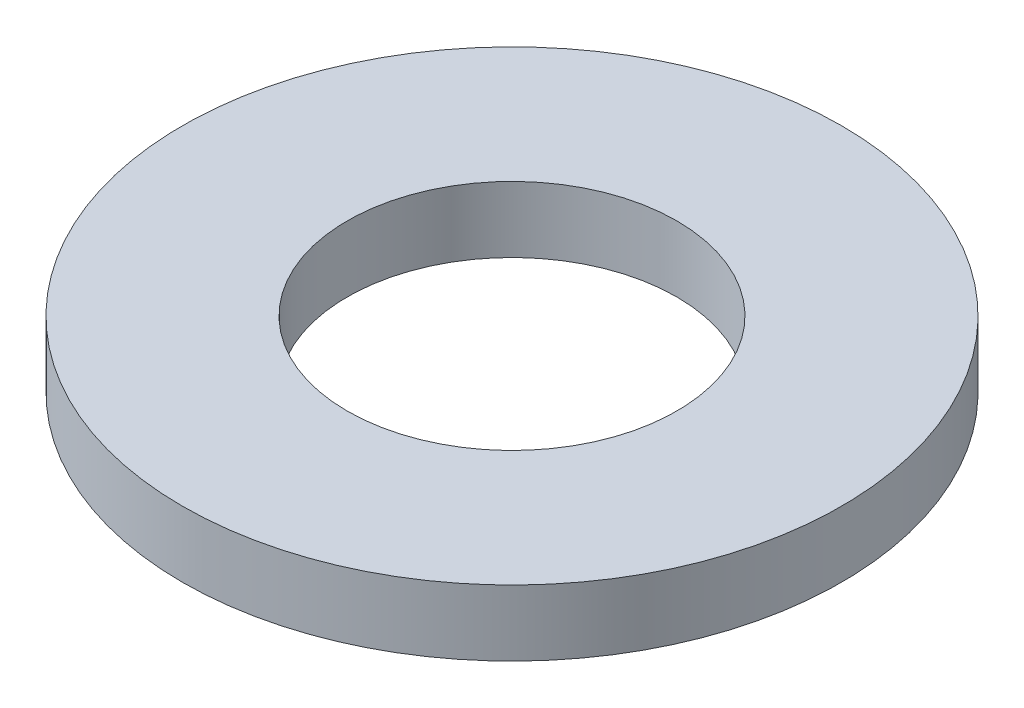
ISO-10303-21;
HEADER;
FILE_DESCRIPTION(('STEP AP214'),'2;1');
FILE_NAME('part.step','',(''),(''),'','','');
FILE_SCHEMA(('AUTOMOTIVE_DESIGN { 1 0 10303 214 1 1 1 1 }'));
ENDSEC;
DATA;
#1=APPLICATION_CONTEXT('core data for automotive mechanical design processes');
#2=APPLICATION_PROTOCOL_DEFINITION('international standard','automotive_design',2000,#1);
#3=PRODUCT_CONTEXT('',#1,'mechanical');
#4=PRODUCT('Part','Part','',(#3));
#5=PRODUCT_RELATED_PRODUCT_CATEGORY('part','',(#4));
#6=PRODUCT_DEFINITION_FORMATION('','',#4);
#7=PRODUCT_DEFINITION_CONTEXT('part definition',#1,'design');
#8=PRODUCT_DEFINITION('design','',#6,#7);
#9=PRODUCT_DEFINITION_SHAPE('','',#8);
#10=(LENGTH_UNIT() NAMED_UNIT(*) SI_UNIT(.MILLI.,.METRE.));
#11=(NAMED_UNIT(*) PLANE_ANGLE_UNIT() SI_UNIT($,.RADIAN.));
#12=(NAMED_UNIT(*) SI_UNIT($,.STERADIAN.) SOLID_ANGLE_UNIT());
#13=UNCERTAINTY_MEASURE_WITH_UNIT(LENGTH_MEASURE(1.E-05),#10,'distance_accuracy_value','');
#14=(GEOMETRIC_REPRESENTATION_CONTEXT(3) GLOBAL_UNCERTAINTY_ASSIGNED_CONTEXT((#13)) GLOBAL_UNIT_ASSIGNED_CONTEXT((#10,
#11,#12)) REPRESENTATION_CONTEXT('',''));
#15=CARTESIAN_POINT('',(0.,0.,0.));
#16=DIRECTION('',(0.,0.,1.));
#17=DIRECTION('',(1.,0.,0.));
#18=AXIS2_PLACEMENT_3D('',#15,#16,#17);
#19=CARTESIAN_POINT('',(0.,7.,0.));
#20=DIRECTION('',(0.,-1.,0.));
#21=DIRECTION('',(0.,0.,-1.));
#22=AXIS2_PLACEMENT_3D('',#19,#20,#21);
#23=CYLINDRICAL_SURFACE('',#22,35.);
#24=CARTESIAN_POINT('',(0.,7.,0.));
#25=DIRECTION('',(0.,1.,0.));
#26=DIRECTION('',(0.,0.,1.));
#27=AXIS2_PLACEMENT_3D('',#24,#25,#26);
#28=CIRCLE('',#27,35.);
#29=CARTESIAN_POINT('',(0.,7.,35.));
#30=VERTEX_POINT('',#29);
#31=EDGE_CURVE('E10',#30,#30,#28,.T.);
#32=ORIENTED_EDGE('',*,*,#31,.F.);
#33=EDGE_LOOP('',(#32));
#34=FACE_BOUND('',#33,.T.);
#35=CARTESIAN_POINT('',(0.,0.,0.));
#36=DIRECTION('',(0.,1.,0.));
#37=DIRECTION('',(0.,0.,1.));
#38=AXIS2_PLACEMENT_3D('',#35,#36,#37);
#39=CIRCLE('',#38,35.);
#40=CARTESIAN_POINT('',(0.,0.,35.));
#41=VERTEX_POINT('',#40);
#42=EDGE_CURVE('E37',#41,#41,#39,.T.);
#43=ORIENTED_EDGE('',*,*,#42,.T.);
#44=EDGE_LOOP('',(#43));
#45=FACE_BOUND('',#44,.T.);
#46=ADVANCED_FACE('F40',(#34,#45),#23,.T.);
#47=CARTESIAN_POINT('',(0.,7.,0.));
#48=DIRECTION('',(0.,1.,0.));
#49=DIRECTION('',(0.,0.,1.));
#50=AXIS2_PLACEMENT_3D('',#47,#48,#49);
#51=PLANE('',#50);
#52=CARTESIAN_POINT('',(0.,7.,0.));
#53=DIRECTION('',(0.,1.,0.));
#54=DIRECTION('',(0.,0.,1.));
#55=AXIS2_PLACEMENT_3D('',#52,#53,#54);
#56=CIRCLE('',#55,17.5);
#57=CARTESIAN_POINT('',(0.,7.,17.5));
#58=VERTEX_POINT('',#57);
#59=EDGE_CURVE('E50',#58,#58,#56,.T.);
#60=ORIENTED_EDGE('',*,*,#59,.F.);
#61=EDGE_LOOP('',(#60));
#62=FACE_BOUND('',#61,.T.);
#63=ORIENTED_EDGE('',*,*,#31,.T.);
#64=EDGE_LOOP('',(#63));
#65=FACE_BOUND('',#64,.T.);
#66=ADVANCED_FACE('F59',(#62,#65),#51,.T.);
#67=CARTESIAN_POINT('',(0.,0.,0.));
#68=DIRECTION('',(0.,1.,0.));
#69=DIRECTION('',(0.,0.,1.));
#70=AXIS2_PLACEMENT_3D('',#67,#68,#69);
#71=PLANE('',#70);
#72=CARTESIAN_POINT('',(0.,0.,0.));
#73=DIRECTION('',(0.,1.,0.));
#74=DIRECTION('',(0.,0.,1.));
#75=AXIS2_PLACEMENT_3D('',#72,#73,#74);
#76=CIRCLE('',#75,17.5);
#77=CARTESIAN_POINT('',(0.,0.,17.5));
#78=VERTEX_POINT('',#77);
#79=EDGE_CURVE('E47',#78,#78,#76,.T.);
#80=ORIENTED_EDGE('',*,*,#79,.T.);
#81=EDGE_LOOP('',(#80));
#82=FACE_BOUND('',#81,.T.);
#83=ORIENTED_EDGE('',*,*,#42,.F.);
#84=EDGE_LOOP('',(#83));
#85=FACE_BOUND('',#84,.T.);
#86=ADVANCED_FACE('F58',(#82,#85),#71,.F.);
#87=CARTESIAN_POINT('',(0.,7.,0.));
#88=DIRECTION('',(0.,-1.,0.));
#89=DIRECTION('',(0.,0.,-1.));
#90=AXIS2_PLACEMENT_3D('',#87,#88,#89);
#91=CYLINDRICAL_SURFACE('',#90,17.5);
#92=ORIENTED_EDGE('',*,*,#59,.T.);
#93=EDGE_LOOP('',(#92));
#94=FACE_BOUND('',#93,.T.);
#95=ORIENTED_EDGE('',*,*,#79,.F.);
#96=EDGE_LOOP('',(#95));
#97=FACE_BOUND('',#96,.T.);
#98=ADVANCED_FACE('F54',(#94,#97),#91,.F.);
#99=CLOSED_SHELL('',(#46,#66,#86,#98));
#100=MANIFOLD_SOLID_BREP('B2',#99);
#101=ADVANCED_BREP_SHAPE_REPRESENTATION('',(#18,#100),#14);
#102=SHAPE_DEFINITION_REPRESENTATION(#9,#101);
ENDSEC;
END-ISO-10303-21;
